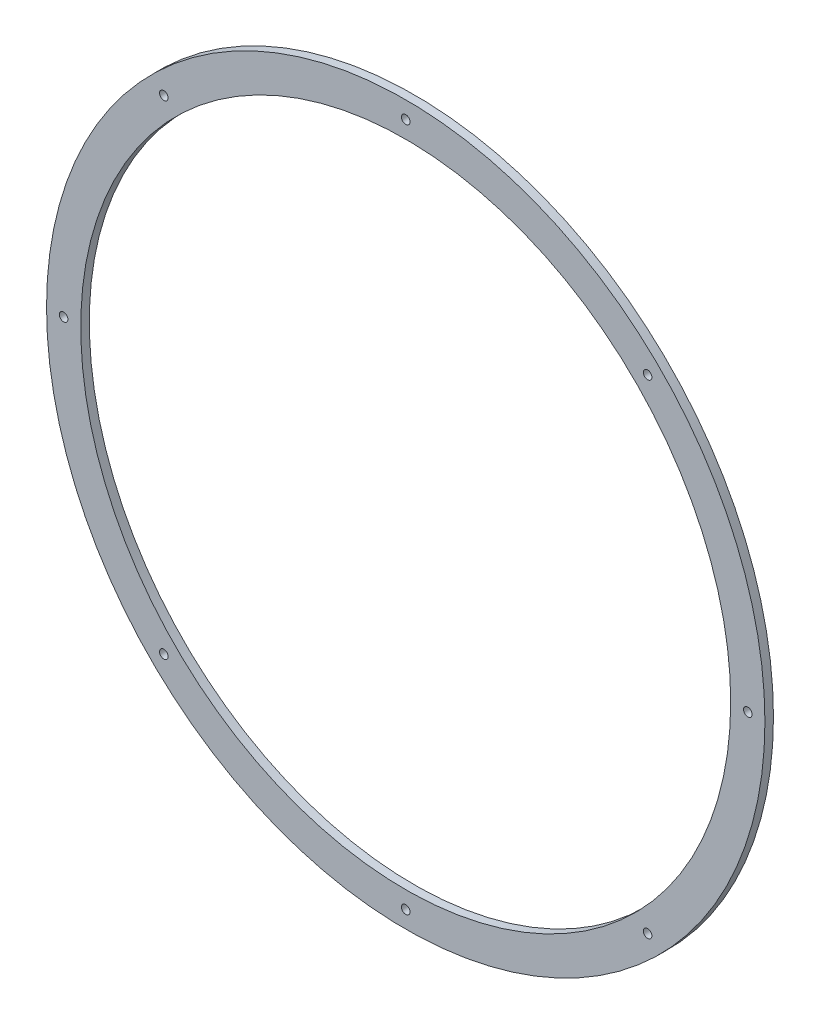
ISO-10303-21;
HEADER;
FILE_DESCRIPTION(('STEP AP214'),'2;1');
FILE_NAME('part.step','',(''),(''),'','','');
FILE_SCHEMA(('AUTOMOTIVE_DESIGN { 1 0 10303 214 1 1 1 1 }'));
ENDSEC;
DATA;
#1=APPLICATION_CONTEXT('core data for automotive mechanical design processes');
#2=APPLICATION_PROTOCOL_DEFINITION('international standard','automotive_design',2000,#1);
#3=PRODUCT_CONTEXT('',#1,'mechanical');
#4=PRODUCT('Part','Part','',(#3));
#5=PRODUCT_RELATED_PRODUCT_CATEGORY('part','',(#4));
#6=PRODUCT_DEFINITION_FORMATION('','',#4);
#7=PRODUCT_DEFINITION_CONTEXT('part definition',#1,'design');
#8=PRODUCT_DEFINITION('design','',#6,#7);
#9=PRODUCT_DEFINITION_SHAPE('','',#8);
#10=(LENGTH_UNIT() NAMED_UNIT(*) SI_UNIT(.MILLI.,.METRE.));
#11=(NAMED_UNIT(*) PLANE_ANGLE_UNIT() SI_UNIT($,.RADIAN.));
#12=(NAMED_UNIT(*) SI_UNIT($,.STERADIAN.) SOLID_ANGLE_UNIT());
#13=UNCERTAINTY_MEASURE_WITH_UNIT(LENGTH_MEASURE(1.E-05),#10,'distance_accuracy_value','');
#14=(GEOMETRIC_REPRESENTATION_CONTEXT(3) GLOBAL_UNCERTAINTY_ASSIGNED_CONTEXT((#13)) GLOBAL_UNIT_ASSIGNED_CONTEXT((#10,
#11,#12)) REPRESENTATION_CONTEXT('',''));
#15=CARTESIAN_POINT('',(0.,0.,0.));
#16=DIRECTION('',(0.,0.,1.));
#17=DIRECTION('',(1.,0.,0.));
#18=AXIS2_PLACEMENT_3D('',#15,#16,#17);
#19=CARTESIAN_POINT('',(0.,0.,5.00000000000012));
#20=DIRECTION('',(0.,0.,1.));
#21=DIRECTION('',(1.00000000000001,0.,0.));
#22=AXIS2_PLACEMENT_3D('',#19,#20,#21);
#23=PLANE('',#22);
#24=CARTESIAN_POINT('',(-200.000000000003,-6.99093560818656E-13,4.99999999999989));
#25=DIRECTION('',(0.,0.,1.));
#26=DIRECTION('',(0.,1.00000000000001,0.));
#27=AXIS2_PLACEMENT_3D('',#24,#25,#26);
#28=CIRCLE('',#27,2.49999999999998);
#29=CARTESIAN_POINT('',(-200.000000000003,2.49999999999931,4.99999999999989));
#30=VERTEX_POINT('',#29);
#31=EDGE_CURVE('E81',#30,#30,#28,.T.);
#32=ORIENTED_EDGE('',*,*,#31,.F.);
#33=EDGE_LOOP('',(#32));
#34=FACE_BOUND('',#33,.T.);
#35=CARTESIAN_POINT('',(-141.42135623731,-141.421356237312,5.00000000000012));
#36=DIRECTION('',(0.,0.,1.));
#37=DIRECTION('',(-0.707106781186558,0.70710678118655,0.));
#38=AXIS2_PLACEMENT_3D('',#35,#36,#37);
#39=CIRCLE('',#38,2.49999999999998);
#40=CARTESIAN_POINT('',(-143.189123190277,-139.653589284346,5.00000000000012));
#41=VERTEX_POINT('',#40);
#42=EDGE_CURVE('E100',#41,#41,#39,.T.);
#43=ORIENTED_EDGE('',*,*,#42,.F.);
#44=EDGE_LOOP('',(#43));
#45=FACE_BOUND('',#44,.T.);
#46=CARTESIAN_POINT('',(0.,-200.000000000003,5.00000000000012));
#47=DIRECTION('',(0.,0.,1.));
#48=DIRECTION('',(-1.00000000000001,0.,0.));
#49=AXIS2_PLACEMENT_3D('',#46,#47,#48);
#50=CIRCLE('',#49,2.49999999999998);
#51=CARTESIAN_POINT('',(-2.50000000000001,-200.000000000003,5.00000000000012));
#52=VERTEX_POINT('',#51);
#53=EDGE_CURVE('E92',#52,#52,#50,.T.);
#54=ORIENTED_EDGE('',*,*,#53,.F.);
#55=EDGE_LOOP('',(#54));
#56=FACE_BOUND('',#55,.T.);
#57=CARTESIAN_POINT('',(141.421356237312,-141.42135623731,4.99999999999989));
#58=DIRECTION('',(0.,0.,1.));
#59=DIRECTION('',(-0.707106781186548,-0.70710678118656,0.));
#60=AXIS2_PLACEMENT_3D('',#57,#58,#59);
#61=CIRCLE('',#60,2.49999999999998);
#62=CARTESIAN_POINT('',(139.653589284346,-143.189123190276,4.99999999999989));
#63=VERTEX_POINT('',#62);
#64=EDGE_CURVE('E82',#63,#63,#61,.T.);
#65=ORIENTED_EDGE('',*,*,#64,.F.);
#66=EDGE_LOOP('',(#65));
#67=FACE_BOUND('',#66,.T.);
#68=CARTESIAN_POINT('',(200.000000000003,2.09554595897999E-12,4.99999999999989));
#69=DIRECTION('',(0.,0.,1.));
#70=DIRECTION('',(0.,-1.00000000000001,0.));
#71=AXIS2_PLACEMENT_3D('',#68,#69,#70);
#72=CIRCLE('',#71,2.49999999999998);
#73=CARTESIAN_POINT('',(200.000000000003,-2.49999999999792,4.99999999999989));
#74=VERTEX_POINT('',#73);
#75=EDGE_CURVE('E91',#74,#74,#72,.T.);
#76=ORIENTED_EDGE('',*,*,#75,.F.);
#77=EDGE_LOOP('',(#76));
#78=FACE_BOUND('',#77,.T.);
#79=CARTESIAN_POINT('',(141.421356237309,141.421356237313,4.99999999999989));
#80=DIRECTION('',(0.,0.,1.));
#81=DIRECTION('',(0.707106781186563,-0.707106781186546,0.));
#82=AXIS2_PLACEMENT_3D('',#79,#80,#81);
#83=CIRCLE('',#82,2.49999999999998);
#84=CARTESIAN_POINT('',(143.189123190276,139.653589284347,4.99999999999989));
#85=VERTEX_POINT('',#84);
#86=EDGE_CURVE('E113',#85,#85,#83,.T.);
#87=ORIENTED_EDGE('',*,*,#86,.F.);
#88=EDGE_LOOP('',(#87));
#89=FACE_BOUND('',#88,.T.);
#90=CARTESIAN_POINT('',(-141.421356237311,141.421356237311,5.00000000000012));
#91=DIRECTION('',(0.,0.,1.));
#92=DIRECTION('',(0.707106781186553,0.707106781186555,0.));
#93=AXIS2_PLACEMENT_3D('',#90,#91,#92);
#94=CIRCLE('',#93,2.49999999999998);
#95=CARTESIAN_POINT('',(-139.653589284345,143.189123190277,5.00000000000012));
#96=VERTEX_POINT('',#95);
#97=EDGE_CURVE('E74',#96,#96,#94,.T.);
#98=ORIENTED_EDGE('',*,*,#97,.F.);
#99=EDGE_LOOP('',(#98));
#100=FACE_BOUND('',#99,.T.);
#101=CARTESIAN_POINT('',(0.,200.000000000003,5.00000000000012));
#102=DIRECTION('',(0.,0.,1.));
#103=DIRECTION('',(1.00000000000001,0.,0.));
#104=AXIS2_PLACEMENT_3D('',#101,#102,#103);
#105=CIRCLE('',#104,2.49999999999998);
#106=CARTESIAN_POINT('',(2.50000000000001,200.000000000003,5.00000000000012));
#107=VERTEX_POINT('',#106);
#108=EDGE_CURVE('E70',#107,#107,#105,.T.);
#109=ORIENTED_EDGE('',*,*,#108,.F.);
#110=EDGE_LOOP('',(#109));
#111=FACE_BOUND('',#110,.T.);
#112=CARTESIAN_POINT('',(0.,0.,5.00000000000012));
#113=DIRECTION('',(0.,0.,1.));
#114=DIRECTION('',(1.00000000000001,0.,0.));
#115=AXIS2_PLACEMENT_3D('',#112,#113,#114);
#116=CIRCLE('',#115,210.);
#117=CARTESIAN_POINT('',(210.000000000003,0.,5.00000000000012));
#118=VERTEX_POINT('',#117);
#119=EDGE_CURVE('E10',#118,#118,#116,.T.);
#120=ORIENTED_EDGE('',*,*,#119,.T.);
#121=EDGE_LOOP('',(#120));
#122=FACE_BOUND('',#121,.T.);
#123=CARTESIAN_POINT('',(0.,0.,5.00000000000012));
#124=DIRECTION('',(0.,0.,1.));
#125=DIRECTION('',(1.00000000000001,0.,0.));
#126=AXIS2_PLACEMENT_3D('',#123,#124,#125);
#127=CIRCLE('',#126,190.);
#128=CARTESIAN_POINT('',(190.000000000003,0.,5.00000000000012));
#129=VERTEX_POINT('',#128);
#130=EDGE_CURVE('E57',#129,#129,#127,.T.);
#131=ORIENTED_EDGE('',*,*,#130,.F.);
#132=EDGE_LOOP('',(#131));
#133=FACE_BOUND('',#132,.T.);
#134=ADVANCED_FACE('F42',(#34,#45,#56,#67,#78,#89,#100,#111,#122,#133),#23,.T.);
#135=CARTESIAN_POINT('',(0.,0.,0.));
#136=DIRECTION('',(0.,0.,1.));
#137=DIRECTION('',(1.00000000000001,0.,0.));
#138=AXIS2_PLACEMENT_3D('',#135,#136,#137);
#139=PLANE('',#138);
#140=CARTESIAN_POINT('',(-200.000000000003,-6.99093560818656E-13,0.));
#141=DIRECTION('',(0.,0.,1.));
#142=DIRECTION('',(0.,1.00000000000001,0.));
#143=AXIS2_PLACEMENT_3D('',#140,#141,#142);
#144=CIRCLE('',#143,2.49999999999998);
#145=CARTESIAN_POINT('',(-200.000000000003,2.49999999999931,0.));
#146=VERTEX_POINT('',#145);
#147=EDGE_CURVE('E104',#146,#146,#144,.T.);
#148=ORIENTED_EDGE('',*,*,#147,.T.);
#149=EDGE_LOOP('',(#148));
#150=FACE_BOUND('',#149,.T.);
#151=CARTESIAN_POINT('',(-141.42135623731,-141.421356237312,0.));
#152=DIRECTION('',(0.,0.,1.));
#153=DIRECTION('',(-0.707106781186558,0.70710678118655,0.));
#154=AXIS2_PLACEMENT_3D('',#151,#152,#153);
#155=CIRCLE('',#154,2.49999999999998);
#156=CARTESIAN_POINT('',(-143.189123190277,-139.653589284346,0.));
#157=VERTEX_POINT('',#156);
#158=EDGE_CURVE('E96',#157,#157,#155,.T.);
#159=ORIENTED_EDGE('',*,*,#158,.T.);
#160=EDGE_LOOP('',(#159));
#161=FACE_BOUND('',#160,.T.);
#162=CARTESIAN_POINT('',(0.,-200.000000000003,0.));
#163=DIRECTION('',(0.,0.,1.));
#164=DIRECTION('',(-1.00000000000001,0.,0.));
#165=AXIS2_PLACEMENT_3D('',#162,#163,#164);
#166=CIRCLE('',#165,2.49999999999998);
#167=CARTESIAN_POINT('',(-2.50000000000001,-200.000000000003,0.));
#168=VERTEX_POINT('',#167);
#169=EDGE_CURVE('E86',#168,#168,#166,.T.);
#170=ORIENTED_EDGE('',*,*,#169,.T.);
#171=EDGE_LOOP('',(#170));
#172=FACE_BOUND('',#171,.T.);
#173=CARTESIAN_POINT('',(141.421356237312,-141.42135623731,0.));
#174=DIRECTION('',(0.,0.,1.));
#175=DIRECTION('',(-0.707106781186548,-0.70710678118656,0.));
#176=AXIS2_PLACEMENT_3D('',#173,#174,#175);
#177=CIRCLE('',#176,2.49999999999998);
#178=CARTESIAN_POINT('',(139.653589284346,-143.189123190276,0.));
#179=VERTEX_POINT('',#178);
#180=EDGE_CURVE('E87',#179,#179,#177,.T.);
#181=ORIENTED_EDGE('',*,*,#180,.T.);
#182=EDGE_LOOP('',(#181));
#183=FACE_BOUND('',#182,.T.);
#184=CARTESIAN_POINT('',(200.000000000003,2.09554595897999E-12,0.));
#185=DIRECTION('',(0.,0.,1.));
#186=DIRECTION('',(0.,-1.00000000000001,0.));
#187=AXIS2_PLACEMENT_3D('',#184,#185,#186);
#188=CIRCLE('',#187,2.49999999999998);
#189=CARTESIAN_POINT('',(200.000000000003,-2.49999999999792,0.));
#190=VERTEX_POINT('',#189);
#191=EDGE_CURVE('E117',#190,#190,#188,.T.);
#192=ORIENTED_EDGE('',*,*,#191,.T.);
#193=EDGE_LOOP('',(#192));
#194=FACE_BOUND('',#193,.T.);
#195=CARTESIAN_POINT('',(141.421356237309,141.421356237313,0.));
#196=DIRECTION('',(0.,0.,1.));
#197=DIRECTION('',(0.707106781186563,-0.707106781186546,0.));
#198=AXIS2_PLACEMENT_3D('',#195,#196,#197);
#199=CIRCLE('',#198,2.49999999999998);
#200=CARTESIAN_POINT('',(143.189123190276,139.653589284347,0.));
#201=VERTEX_POINT('',#200);
#202=EDGE_CURVE('E118',#201,#201,#199,.T.);
#203=ORIENTED_EDGE('',*,*,#202,.T.);
#204=EDGE_LOOP('',(#203));
#205=FACE_BOUND('',#204,.T.);
#206=CARTESIAN_POINT('',(-141.421356237311,141.421356237311,0.));
#207=DIRECTION('',(0.,0.,1.));
#208=DIRECTION('',(0.707106781186553,0.707106781186555,0.));
#209=AXIS2_PLACEMENT_3D('',#206,#207,#208);
#210=CIRCLE('',#209,2.49999999999998);
#211=CARTESIAN_POINT('',(-139.653589284345,143.189123190277,0.));
#212=VERTEX_POINT('',#211);
#213=EDGE_CURVE('E78',#212,#212,#210,.T.);
#214=ORIENTED_EDGE('',*,*,#213,.T.);
#215=EDGE_LOOP('',(#214));
#216=FACE_BOUND('',#215,.T.);
#217=CARTESIAN_POINT('',(0.,200.000000000003,0.));
#218=DIRECTION('',(0.,0.,1.));
#219=DIRECTION('',(1.00000000000001,0.,0.));
#220=AXIS2_PLACEMENT_3D('',#217,#218,#219);
#221=CIRCLE('',#220,2.49999999999998);
#222=CARTESIAN_POINT('',(2.50000000000001,200.000000000003,0.));
#223=VERTEX_POINT('',#222);
#224=EDGE_CURVE('E63',#223,#223,#221,.T.);
#225=ORIENTED_EDGE('',*,*,#224,.T.);
#226=EDGE_LOOP('',(#225));
#227=FACE_BOUND('',#226,.T.);
#228=CARTESIAN_POINT('',(0.,0.,0.));
#229=DIRECTION('',(0.,0.,1.));
#230=DIRECTION('',(1.00000000000001,0.,0.));
#231=AXIS2_PLACEMENT_3D('',#228,#229,#230);
#232=CIRCLE('',#231,210.);
#233=CARTESIAN_POINT('',(210.000000000003,0.,0.));
#234=VERTEX_POINT('',#233);
#235=EDGE_CURVE('E46',#234,#234,#232,.T.);
#236=ORIENTED_EDGE('',*,*,#235,.F.);
#237=EDGE_LOOP('',(#236));
#238=FACE_BOUND('',#237,.T.);
#239=CARTESIAN_POINT('',(0.,0.,0.));
#240=DIRECTION('',(0.,0.,1.));
#241=DIRECTION('',(1.00000000000001,0.,0.));
#242=AXIS2_PLACEMENT_3D('',#239,#240,#241);
#243=CIRCLE('',#242,190.);
#244=CARTESIAN_POINT('',(190.000000000003,0.,0.));
#245=VERTEX_POINT('',#244);
#246=EDGE_CURVE('E59',#245,#245,#243,.T.);
#247=ORIENTED_EDGE('',*,*,#246,.T.);
#248=EDGE_LOOP('',(#247));
#249=FACE_BOUND('',#248,.T.);
#250=ADVANCED_FACE('F129',(#150,#161,#172,#183,#194,#205,#216,#227,#238,#249),#139,.F.);
#251=CARTESIAN_POINT('',(0.,0.,5.00000000000012));
#252=DIRECTION('',(0.,0.,-1.));
#253=DIRECTION('',(-1.00000000000001,0.,0.));
#254=AXIS2_PLACEMENT_3D('',#251,#252,#253);
#255=CYLINDRICAL_SURFACE('',#254,210.);
#256=ORIENTED_EDGE('',*,*,#119,.F.);
#257=EDGE_LOOP('',(#256));
#258=FACE_BOUND('',#257,.T.);
#259=ORIENTED_EDGE('',*,*,#235,.T.);
#260=EDGE_LOOP('',(#259));
#261=FACE_BOUND('',#260,.T.);
#262=ADVANCED_FACE('F44',(#258,#261),#255,.T.);
#263=CARTESIAN_POINT('',(0.,0.,5.00000000000012));
#264=DIRECTION('',(0.,0.,-1.));
#265=DIRECTION('',(-1.00000000000001,0.,0.));
#266=AXIS2_PLACEMENT_3D('',#263,#264,#265);
#267=CYLINDRICAL_SURFACE('',#266,190.);
#268=ORIENTED_EDGE('',*,*,#130,.T.);
#269=EDGE_LOOP('',(#268));
#270=FACE_BOUND('',#269,.T.);
#271=ORIENTED_EDGE('',*,*,#246,.F.);
#272=EDGE_LOOP('',(#271));
#273=FACE_BOUND('',#272,.T.);
#274=ADVANCED_FACE('F152',(#270,#273),#267,.F.);
#275=CARTESIAN_POINT('',(0.,200.000000000003,5.00000000000012));
#276=DIRECTION('',(0.,0.,1.));
#277=DIRECTION('',(1.00000000000001,0.,0.));
#278=AXIS2_PLACEMENT_3D('',#275,#276,#277);
#279=CYLINDRICAL_SURFACE('',#278,2.49999999999998);
#280=ORIENTED_EDGE('',*,*,#224,.F.);
#281=EDGE_LOOP('',(#280));
#282=FACE_BOUND('',#281,.T.);
#283=ORIENTED_EDGE('',*,*,#108,.T.);
#284=EDGE_LOOP('',(#283));
#285=FACE_BOUND('',#284,.T.);
#286=ADVANCED_FACE('F155',(#282,#285),#279,.F.);
#287=CARTESIAN_POINT('',(-141.421356237311,141.421356237311,5.00000000000012));
#288=DIRECTION('',(0.,0.,1.));
#289=DIRECTION('',(0.707106781186553,0.707106781186555,0.));
#290=AXIS2_PLACEMENT_3D('',#287,#288,#289);
#291=CYLINDRICAL_SURFACE('',#290,2.49999999999998);
#292=ORIENTED_EDGE('',*,*,#213,.F.);
#293=EDGE_LOOP('',(#292));
#294=FACE_BOUND('',#293,.T.);
#295=ORIENTED_EDGE('',*,*,#97,.T.);
#296=EDGE_LOOP('',(#295));
#297=FACE_BOUND('',#296,.T.);
#298=ADVANCED_FACE('F169',(#294,#297),#291,.F.);
#299=CARTESIAN_POINT('',(141.421356237309,141.421356237313,4.99999999999989));
#300=DIRECTION('',(0.,0.,1.));
#301=DIRECTION('',(0.707106781186563,-0.707106781186546,0.));
#302=AXIS2_PLACEMENT_3D('',#299,#300,#301);
#303=CYLINDRICAL_SURFACE('',#302,2.49999999999998);
#304=ORIENTED_EDGE('',*,*,#202,.F.);
#305=EDGE_LOOP('',(#304));
#306=FACE_BOUND('',#305,.T.);
#307=ORIENTED_EDGE('',*,*,#86,.T.);
#308=EDGE_LOOP('',(#307));
#309=FACE_BOUND('',#308,.T.);
#310=ADVANCED_FACE('F136',(#306,#309),#303,.F.);
#311=CARTESIAN_POINT('',(200.000000000003,2.09554595897999E-12,4.99999999999989));
#312=DIRECTION('',(0.,0.,1.));
#313=DIRECTION('',(0.,-1.00000000000001,0.));
#314=AXIS2_PLACEMENT_3D('',#311,#312,#313);
#315=CYLINDRICAL_SURFACE('',#314,2.49999999999998);
#316=ORIENTED_EDGE('',*,*,#191,.F.);
#317=EDGE_LOOP('',(#316));
#318=FACE_BOUND('',#317,.T.);
#319=ORIENTED_EDGE('',*,*,#75,.T.);
#320=EDGE_LOOP('',(#319));
#321=FACE_BOUND('',#320,.T.);
#322=ADVANCED_FACE('F132',(#318,#321),#315,.F.);
#323=CARTESIAN_POINT('',(141.421356237312,-141.42135623731,4.99999999999989));
#324=DIRECTION('',(0.,0.,1.));
#325=DIRECTION('',(-0.707106781186548,-0.70710678118656,0.));
#326=AXIS2_PLACEMENT_3D('',#323,#324,#325);
#327=CYLINDRICAL_SURFACE('',#326,2.49999999999998);
#328=ORIENTED_EDGE('',*,*,#180,.F.);
#329=EDGE_LOOP('',(#328));
#330=FACE_BOUND('',#329,.T.);
#331=ORIENTED_EDGE('',*,*,#64,.T.);
#332=EDGE_LOOP('',(#331));
#333=FACE_BOUND('',#332,.T.);
#334=ADVANCED_FACE('F135',(#330,#333),#327,.F.);
#335=CARTESIAN_POINT('',(0.,-200.000000000003,5.00000000000012));
#336=DIRECTION('',(0.,0.,1.));
#337=DIRECTION('',(-1.00000000000001,0.,0.));
#338=AXIS2_PLACEMENT_3D('',#335,#336,#337);
#339=CYLINDRICAL_SURFACE('',#338,2.49999999999998);
#340=ORIENTED_EDGE('',*,*,#169,.F.);
#341=EDGE_LOOP('',(#340));
#342=FACE_BOUND('',#341,.T.);
#343=ORIENTED_EDGE('',*,*,#53,.T.);
#344=EDGE_LOOP('',(#343));
#345=FACE_BOUND('',#344,.T.);
#346=ADVANCED_FACE('F176',(#342,#345),#339,.F.);
#347=CARTESIAN_POINT('',(-141.42135623731,-141.421356237312,5.00000000000012));
#348=DIRECTION('',(0.,0.,1.));
#349=DIRECTION('',(-0.707106781186558,0.70710678118655,0.));
#350=AXIS2_PLACEMENT_3D('',#347,#348,#349);
#351=CYLINDRICAL_SURFACE('',#350,2.49999999999998);
#352=ORIENTED_EDGE('',*,*,#158,.F.);
#353=EDGE_LOOP('',(#352));
#354=FACE_BOUND('',#353,.T.);
#355=ORIENTED_EDGE('',*,*,#42,.T.);
#356=EDGE_LOOP('',(#355));
#357=FACE_BOUND('',#356,.T.);
#358=ADVANCED_FACE('F180',(#354,#357),#351,.F.);
#359=CARTESIAN_POINT('',(-200.000000000003,-6.99093560818656E-13,4.99999999999989));
#360=DIRECTION('',(0.,0.,1.));
#361=DIRECTION('',(0.,1.00000000000001,0.));
#362=AXIS2_PLACEMENT_3D('',#359,#360,#361);
#363=CYLINDRICAL_SURFACE('',#362,2.49999999999998);
#364=ORIENTED_EDGE('',*,*,#147,.F.);
#365=EDGE_LOOP('',(#364));
#366=FACE_BOUND('',#365,.T.);
#367=ORIENTED_EDGE('',*,*,#31,.T.);
#368=EDGE_LOOP('',(#367));
#369=FACE_BOUND('',#368,.T.);
#370=ADVANCED_FACE('F184',(#366,#369),#363,.F.);
#371=CLOSED_SHELL('',(#134,#250,#262,#274,#286,#298,#310,#322,#334,#346,#358,#370));
#372=MANIFOLD_SOLID_BREP('B2',#371);
#373=ADVANCED_BREP_SHAPE_REPRESENTATION('',(#18,#372),#14);
#374=SHAPE_DEFINITION_REPRESENTATION(#9,#373);
ENDSEC;
END-ISO-10303-21;
